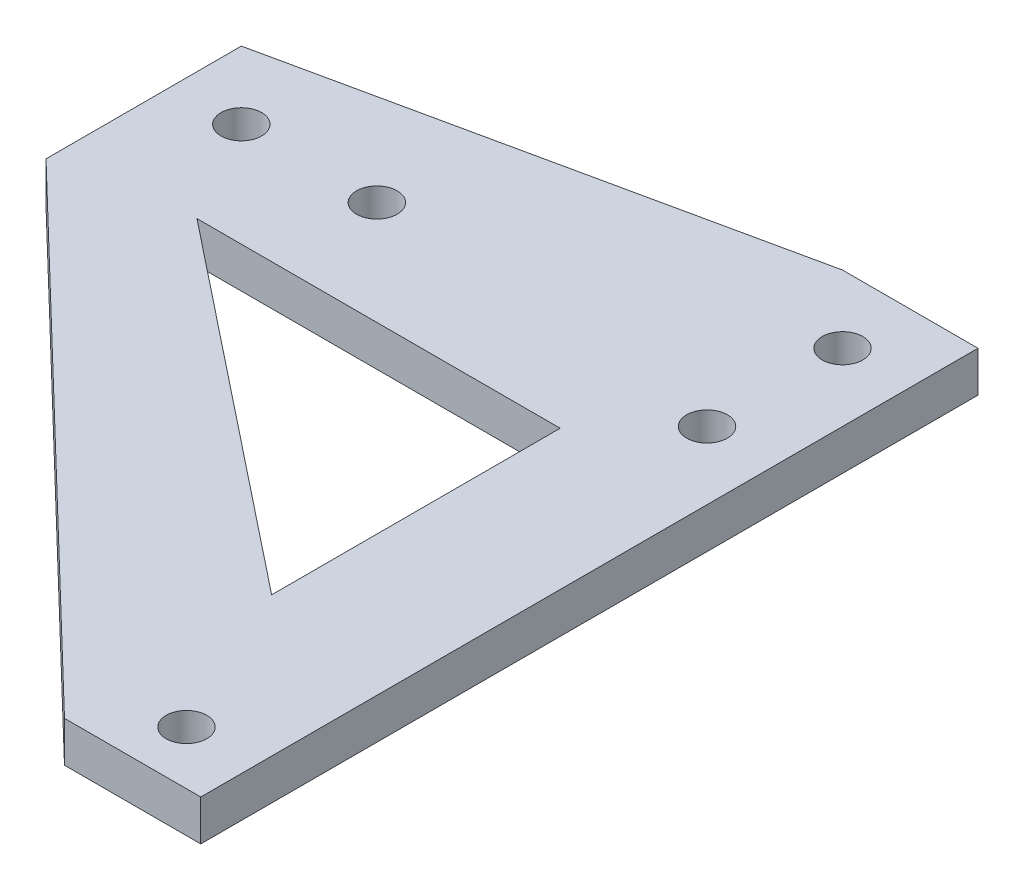
ISO-10303-21;
HEADER;
FILE_DESCRIPTION(('STEP AP214'),'2;1');
FILE_NAME('part.step','',(''),(''),'','','');
FILE_SCHEMA(('AUTOMOTIVE_DESIGN { 1 0 10303 214 1 1 1 1 }'));
ENDSEC;
DATA;
#1=APPLICATION_CONTEXT('core data for automotive mechanical design processes');
#2=APPLICATION_PROTOCOL_DEFINITION('international standard','automotive_design',2000,#1);
#3=PRODUCT_CONTEXT('',#1,'mechanical');
#4=PRODUCT('Part','Part','',(#3));
#5=PRODUCT_RELATED_PRODUCT_CATEGORY('part','',(#4));
#6=PRODUCT_DEFINITION_FORMATION('','',#4);
#7=PRODUCT_DEFINITION_CONTEXT('part definition',#1,'design');
#8=PRODUCT_DEFINITION('design','',#6,#7);
#9=PRODUCT_DEFINITION_SHAPE('','',#8);
#10=(LENGTH_UNIT() NAMED_UNIT(*) SI_UNIT(.MILLI.,.METRE.));
#11=(NAMED_UNIT(*) PLANE_ANGLE_UNIT() SI_UNIT($,.RADIAN.));
#12=(NAMED_UNIT(*) SI_UNIT($,.STERADIAN.) SOLID_ANGLE_UNIT());
#13=UNCERTAINTY_MEASURE_WITH_UNIT(LENGTH_MEASURE(1.E-05),#10,'distance_accuracy_value','');
#14=(GEOMETRIC_REPRESENTATION_CONTEXT(3) GLOBAL_UNCERTAINTY_ASSIGNED_CONTEXT((#13)) GLOBAL_UNIT_ASSIGNED_CONTEXT((#10,
#11,#12)) REPRESENTATION_CONTEXT('',''));
#15=CARTESIAN_POINT('',(0.,0.,0.));
#16=DIRECTION('',(0.,0.,1.));
#17=DIRECTION('',(1.,0.,0.));
#18=AXIS2_PLACEMENT_3D('',#15,#16,#17);
#19=CARTESIAN_POINT('',(0.,3.,-64.6));
#20=DIRECTION('',(0.,0.,1.));
#21=DIRECTION('',(1.,0.,0.));
#22=AXIS2_PLACEMENT_3D('',#19,#20,#21);
#23=PLANE('',#22);
#24=DIRECTION('',(-1.,0.,0.));
#25=VECTOR('',#24,1.);
#26=CARTESIAN_POINT('',(0.,0.,-64.6));
#27=LINE('',#26,#25);
#28=CARTESIAN_POINT('',(41.5,0.,-64.6));
#29=VERTEX_POINT('',#28);
#30=CARTESIAN_POINT('',(31.5,0.,-64.6));
#31=VERTEX_POINT('',#30);
#32=EDGE_CURVE('E198',#29,#31,#27,.T.);
#33=ORIENTED_EDGE('',*,*,#32,.T.);
#34=DIRECTION('',(0.,-1.,0.));
#35=VECTOR('',#34,1.);
#36=CARTESIAN_POINT('',(31.5,3.,-64.6));
#37=LINE('',#36,#35);
#38=CARTESIAN_POINT('',(31.5,3.,-64.6));
#39=VERTEX_POINT('',#38);
#40=EDGE_CURVE('E234',#39,#31,#37,.T.);
#41=ORIENTED_EDGE('',*,*,#40,.F.);
#42=DIRECTION('',(-1.,0.,0.));
#43=VECTOR('',#42,1.);
#44=CARTESIAN_POINT('',(0.,3.,-64.6));
#45=LINE('',#44,#43);
#46=CARTESIAN_POINT('',(41.5,3.,-64.6));
#47=VERTEX_POINT('',#46);
#48=EDGE_CURVE('E165',#47,#39,#45,.T.);
#49=ORIENTED_EDGE('',*,*,#48,.F.);
#50=DIRECTION('',(0.,-1.,0.));
#51=VECTOR('',#50,1.);
#52=CARTESIAN_POINT('',(41.5,3.,-64.6));
#53=LINE('',#52,#51);
#54=EDGE_CURVE('E197',#47,#29,#53,.T.);
#55=ORIENTED_EDGE('',*,*,#54,.T.);
#56=EDGE_LOOP('',(#33,#41,#49,#55));
#57=FACE_BOUND('',#56,.T.);
#58=ADVANCED_FACE('F45',(#57),#23,.F.);
#59=CARTESIAN_POINT('',(-11.9106417152535,3.,-55.2399520466015));
#60=DIRECTION('',(0.210772639150553,0.,0.97753511168935));
#61=DIRECTION('',(0.977535111689351,0.,-0.210772639150553));
#62=AXIS2_PLACEMENT_3D('',#59,#60,#61);
#63=PLANE('',#62);
#64=DIRECTION('',(-0.977535111689351,0.,0.210772639150553));
#65=VECTOR('',#64,1.);
#66=CARTESIAN_POINT('',(-11.9106417152535,0.,-55.2399520466015));
#67=LINE('',#66,#65);
#68=CARTESIAN_POINT('',(-5.,0.,-56.73));
#69=VERTEX_POINT('',#68);
#70=EDGE_CURVE('E202',#31,#69,#67,.T.);
#71=ORIENTED_EDGE('',*,*,#70,.T.);
#72=DIRECTION('',(0.,-1.,0.));
#73=VECTOR('',#72,1.);
#74=CARTESIAN_POINT('',(-5.,3.,-56.73));
#75=LINE('',#74,#73);
#76=CARTESIAN_POINT('',(-5.,3.,-56.73));
#77=VERTEX_POINT('',#76);
#78=EDGE_CURVE('E230',#77,#69,#75,.T.);
#79=ORIENTED_EDGE('',*,*,#78,.F.);
#80=DIRECTION('',(-0.977535111689351,0.,0.210772639150553));
#81=VECTOR('',#80,1.);
#82=CARTESIAN_POINT('',(-11.9106417152535,3.,-55.2399520466015));
#83=LINE('',#82,#81);
#84=EDGE_CURVE('E169',#39,#77,#83,.T.);
#85=ORIENTED_EDGE('',*,*,#84,.F.);
#86=ORIENTED_EDGE('',*,*,#40,.T.);
#87=EDGE_LOOP('',(#71,#79,#85,#86));
#88=FACE_BOUND('',#87,.T.);
#89=ADVANCED_FACE('F269',(#88),#63,.F.);
#90=CARTESIAN_POINT('',(-5.,3.,0.));
#91=DIRECTION('',(1.,0.,0.));
#92=DIRECTION('',(0.,0.,-1.));
#93=AXIS2_PLACEMENT_3D('',#90,#91,#92);
#94=PLANE('',#93);
#95=DIRECTION('',(0.,0.,1.));
#96=VECTOR('',#95,1.);
#97=CARTESIAN_POINT('',(-5.,0.,0.));
#98=LINE('',#97,#96);
#99=CARTESIAN_POINT('',(-5.,0.,-42.3127995725989));
#100=VERTEX_POINT('',#99);
#101=EDGE_CURVE('E205',#69,#100,#98,.T.);
#102=ORIENTED_EDGE('',*,*,#101,.T.);
#103=DIRECTION('',(0.,1.,0.));
#104=VECTOR('',#103,1.);
#105=CARTESIAN_POINT('',(-5.,-4.,-42.3127995725989));
#106=LINE('',#105,#104);
#107=CARTESIAN_POINT('',(-5.,3.,-42.3127995725989));
#108=VERTEX_POINT('',#107);
#109=EDGE_CURVE('E145',#100,#108,#106,.T.);
#110=ORIENTED_EDGE('',*,*,#109,.T.);
#111=DIRECTION('',(0.,0.,1.));
#112=VECTOR('',#111,1.);
#113=CARTESIAN_POINT('',(-5.,3.,0.));
#114=LINE('',#113,#112);
#115=EDGE_CURVE('E173',#77,#108,#114,.T.);
#116=ORIENTED_EDGE('',*,*,#115,.F.);
#117=ORIENTED_EDGE('',*,*,#78,.T.);
#118=EDGE_LOOP('',(#102,#110,#116,#117));
#119=FACE_BOUND('',#118,.T.);
#120=ADVANCED_FACE('F274',(#119),#94,.F.);
#121=CARTESIAN_POINT('',(36.5,3.,-49.6));
#122=DIRECTION('',(0.,-1.,0.));
#123=DIRECTION('',(0.,0.,-1.));
#124=AXIS2_PLACEMENT_3D('',#121,#122,#123);
#125=CYLINDRICAL_SURFACE('',#124,1.5);
#126=CARTESIAN_POINT('',(36.5,3.,-49.6));
#127=DIRECTION('',(0.,1.,0.));
#128=DIRECTION('',(0.,0.,1.));
#129=AXIS2_PLACEMENT_3D('',#126,#127,#128);
#130=CIRCLE('',#129,1.5);
#131=CARTESIAN_POINT('',(36.5,3.,-48.1));
#132=VERTEX_POINT('',#131);
#133=EDGE_CURVE('E189',#132,#132,#130,.T.);
#134=ORIENTED_EDGE('',*,*,#133,.T.);
#135=EDGE_LOOP('',(#134));
#136=FACE_BOUND('',#135,.T.);
#137=CARTESIAN_POINT('',(36.5,0.,-49.6));
#138=DIRECTION('',(0.,1.,0.));
#139=DIRECTION('',(0.,0.,1.));
#140=AXIS2_PLACEMENT_3D('',#137,#138,#139);
#141=CIRCLE('',#140,1.5);
#142=CARTESIAN_POINT('',(36.5,0.,-48.1));
#143=VERTEX_POINT('',#142);
#144=EDGE_CURVE('E221',#143,#143,#141,.T.);
#145=ORIENTED_EDGE('',*,*,#144,.F.);
#146=EDGE_LOOP('',(#145));
#147=FACE_BOUND('',#146,.T.);
#148=ADVANCED_FACE('F295',(#136,#147),#125,.F.);
#149=CARTESIAN_POINT('',(36.5,3.,-59.6));
#150=DIRECTION('',(0.,-1.,0.));
#151=DIRECTION('',(0.,0.,-1.));
#152=AXIS2_PLACEMENT_3D('',#149,#150,#151);
#153=CYLINDRICAL_SURFACE('',#152,1.5);
#154=CARTESIAN_POINT('',(36.5,3.,-59.6));
#155=DIRECTION('',(0.,1.,0.));
#156=DIRECTION('',(0.,0.,1.));
#157=AXIS2_PLACEMENT_3D('',#154,#155,#156);
#158=CIRCLE('',#157,1.5);
#159=CARTESIAN_POINT('',(36.5,3.,-58.1));
#160=VERTEX_POINT('',#159);
#161=EDGE_CURVE('E185',#160,#160,#158,.T.);
#162=ORIENTED_EDGE('',*,*,#161,.T.);
#163=EDGE_LOOP('',(#162));
#164=FACE_BOUND('',#163,.T.);
#165=CARTESIAN_POINT('',(36.5,0.,-59.6));
#166=DIRECTION('',(0.,1.,0.));
#167=DIRECTION('',(0.,0.,1.));
#168=AXIS2_PLACEMENT_3D('',#165,#166,#167);
#169=CIRCLE('',#168,1.5);
#170=CARTESIAN_POINT('',(36.5,0.,-58.1));
#171=VERTEX_POINT('',#170);
#172=EDGE_CURVE('E217',#171,#171,#169,.T.);
#173=ORIENTED_EDGE('',*,*,#172,.F.);
#174=EDGE_LOOP('',(#173));
#175=FACE_BOUND('',#174,.T.);
#176=ADVANCED_FACE('F300',(#164,#175),#153,.F.);
#177=CARTESIAN_POINT('',(36.5,3.,-11.18));
#178=DIRECTION('',(0.,-1.,0.));
#179=DIRECTION('',(0.,0.,-1.));
#180=AXIS2_PLACEMENT_3D('',#177,#178,#179);
#181=CYLINDRICAL_SURFACE('',#180,1.5);
#182=CARTESIAN_POINT('',(36.5,3.,-11.18));
#183=DIRECTION('',(0.,1.,0.));
#184=DIRECTION('',(0.,0.,1.));
#185=AXIS2_PLACEMENT_3D('',#182,#183,#184);
#186=CIRCLE('',#185,1.5);
#187=CARTESIAN_POINT('',(36.5,3.,-9.67999999999999));
#188=VERTEX_POINT('',#187);
#189=EDGE_CURVE('E181',#188,#188,#186,.T.);
#190=ORIENTED_EDGE('',*,*,#189,.T.);
#191=EDGE_LOOP('',(#190));
#192=FACE_BOUND('',#191,.T.);
#193=CARTESIAN_POINT('',(36.5,0.,-11.18));
#194=DIRECTION('',(0.,1.,0.));
#195=DIRECTION('',(0.,0.,1.));
#196=AXIS2_PLACEMENT_3D('',#193,#194,#195);
#197=CIRCLE('',#196,1.5);
#198=CARTESIAN_POINT('',(36.5,0.,-9.67999999999999));
#199=VERTEX_POINT('',#198);
#200=EDGE_CURVE('E213',#199,#199,#197,.T.);
#201=ORIENTED_EDGE('',*,*,#200,.F.);
#202=EDGE_LOOP('',(#201));
#203=FACE_BOUND('',#202,.T.);
#204=ADVANCED_FACE('F307',(#192,#203),#181,.F.);
#205=CARTESIAN_POINT('',(41.5,3.,0.));
#206=DIRECTION('',(1.,0.,0.));
#207=DIRECTION('',(0.,0.,-1.));
#208=AXIS2_PLACEMENT_3D('',#205,#206,#207);
#209=PLANE('',#208);
#210=DIRECTION('',(0.,1.,0.));
#211=VECTOR('',#210,1.);
#212=CARTESIAN_POINT('',(41.5,-4.,-7.23402453897604));
#213=LINE('',#212,#211);
#214=CARTESIAN_POINT('',(41.5,0.,-7.23402453897604));
#215=VERTEX_POINT('',#214);
#216=CARTESIAN_POINT('',(41.5,3.,-7.23402453897604));
#217=VERTEX_POINT('',#216);
#218=EDGE_CURVE('E157',#215,#217,#213,.T.);
#219=ORIENTED_EDGE('',*,*,#218,.F.);
#220=DIRECTION('',(0.,0.,1.));
#221=VECTOR('',#220,1.);
#222=CARTESIAN_POINT('',(41.5,0.,0.));
#223=LINE('',#222,#221);
#224=EDGE_CURVE('E209',#29,#215,#223,.T.);
#225=ORIENTED_EDGE('',*,*,#224,.F.);
#226=ORIENTED_EDGE('',*,*,#54,.F.);
#227=DIRECTION('',(0.,0.,1.));
#228=VECTOR('',#227,1.);
#229=CARTESIAN_POINT('',(41.5,3.,0.));
#230=LINE('',#229,#228);
#231=EDGE_CURVE('E177',#47,#217,#230,.T.);
#232=ORIENTED_EDGE('',*,*,#231,.T.);
#233=EDGE_LOOP('',(#219,#225,#226,#232));
#234=FACE_BOUND('',#233,.T.);
#235=ADVANCED_FACE('F285',(#234),#209,.T.);
#236=CARTESIAN_POINT('',(0.,3.,-51.73));
#237=DIRECTION('',(0.,-1.,0.));
#238=DIRECTION('',(0.,0.,-1.));
#239=AXIS2_PLACEMENT_3D('',#236,#237,#238);
#240=CYLINDRICAL_SURFACE('',#239,1.5);
#241=CARTESIAN_POINT('',(0.,3.,-51.73));
#242=DIRECTION('',(0.,1.,0.));
#243=DIRECTION('',(0.,0.,1.));
#244=AXIS2_PLACEMENT_3D('',#241,#242,#243);
#245=CIRCLE('',#244,1.5);
#246=CARTESIAN_POINT('',(0.,3.,-50.23));
#247=VERTEX_POINT('',#246);
#248=EDGE_CURVE('E193',#247,#247,#245,.T.);
#249=ORIENTED_EDGE('',*,*,#248,.T.);
#250=EDGE_LOOP('',(#249));
#251=FACE_BOUND('',#250,.T.);
#252=CARTESIAN_POINT('',(0.,0.,-51.73));
#253=DIRECTION('',(0.,1.,0.));
#254=DIRECTION('',(0.,0.,1.));
#255=AXIS2_PLACEMENT_3D('',#252,#253,#254);
#256=CIRCLE('',#255,1.5);
#257=CARTESIAN_POINT('',(0.,0.,-50.23));
#258=VERTEX_POINT('',#257);
#259=EDGE_CURVE('E170',#258,#258,#256,.T.);
#260=ORIENTED_EDGE('',*,*,#259,.F.);
#261=EDGE_LOOP('',(#260));
#262=FACE_BOUND('',#261,.T.);
#263=ADVANCED_FACE('F306',(#251,#262),#240,.F.);
#264=CARTESIAN_POINT('',(0.,3.,0.));
#265=DIRECTION('',(0.,1.,0.));
#266=DIRECTION('',(0.,0.,1.));
#267=AXIS2_PLACEMENT_3D('',#264,#265,#266);
#268=PLANE('',#267);
#269=DIRECTION('',(0.783006018890345,0.,0.622014127155882));
#270=VECTOR('',#269,1.);
#271=CARTESIAN_POINT('',(4.38834668059727,3.,-44.066382221439));
#272=LINE('',#271,#270);
#273=CARTESIAN_POINT('',(4.38834668059727,3.,-44.066382221439));
#274=VERTEX_POINT('',#273);
#275=CARTESIAN_POINT('',(31.1931100271531,3.,-22.7728786283806));
#276=VERTEX_POINT('',#275);
#277=EDGE_CURVE('E60',#274,#276,#272,.T.);
#278=ORIENTED_EDGE('',*,*,#277,.F.);
#279=DIRECTION('',(-1.,0.,0.));
#280=VECTOR('',#279,1.);
#281=CARTESIAN_POINT('',(31.1931100271531,3.,-44.066382221439));
#282=LINE('',#281,#280);
#283=CARTESIAN_POINT('',(31.1931100271531,3.,-44.066382221439));
#284=VERTEX_POINT('',#283);
#285=EDGE_CURVE('E119',#284,#274,#282,.T.);
#286=ORIENTED_EDGE('',*,*,#285,.F.);
#287=DIRECTION('',(0.,0.,-1.));
#288=VECTOR('',#287,1.);
#289=CARTESIAN_POINT('',(31.1931100271531,3.,-22.7728786283806));
#290=LINE('',#289,#288);
#291=EDGE_CURVE('E127',#276,#284,#290,.T.);
#292=ORIENTED_EDGE('',*,*,#291,.F.);
#293=EDGE_LOOP('',(#278,#286,#292));
#294=FACE_BOUND('',#293,.T.);
#295=DIRECTION('',(-0.720469182110105,0.,-0.693486955630455));
#296=VECTOR('',#295,1.);
#297=CARTESIAN_POINT('',(31.4436218341303,3.,-7.23402453897604));
#298=LINE('',#297,#296);
#299=CARTESIAN_POINT('',(31.4436218341303,3.,-7.23402453897604));
#300=VERTEX_POINT('',#299);
#301=EDGE_CURVE('E141',#300,#108,#298,.T.);
#302=ORIENTED_EDGE('',*,*,#301,.F.);
#303=DIRECTION('',(-1.,0.,0.));
#304=VECTOR('',#303,1.);
#305=CARTESIAN_POINT('',(-5.,3.,-7.23402453897604));
#306=LINE('',#305,#304);
#307=EDGE_CURVE('E153',#217,#300,#306,.T.);
#308=ORIENTED_EDGE('',*,*,#307,.F.);
#309=ORIENTED_EDGE('',*,*,#231,.F.);
#310=ORIENTED_EDGE('',*,*,#48,.T.);
#311=ORIENTED_EDGE('',*,*,#84,.T.);
#312=ORIENTED_EDGE('',*,*,#115,.T.);
#313=EDGE_LOOP('',(#302,#308,#309,#310,#311,#312));
#314=FACE_BOUND('',#313,.T.);
#315=CARTESIAN_POINT('',(10.,3.,-51.73));
#316=DIRECTION('',(0.,1.,0.));
#317=DIRECTION('',(0.,0.,1.));
#318=AXIS2_PLACEMENT_3D('',#315,#316,#317);
#319=CIRCLE('',#318,1.5);
#320=CARTESIAN_POINT('',(10.,3.,-50.23));
#321=VERTEX_POINT('',#320);
#322=EDGE_CURVE('E160',#321,#321,#319,.T.);
#323=ORIENTED_EDGE('',*,*,#322,.F.);
#324=EDGE_LOOP('',(#323));
#325=FACE_BOUND('',#324,.T.);
#326=ORIENTED_EDGE('',*,*,#189,.F.);
#327=EDGE_LOOP('',(#326));
#328=FACE_BOUND('',#327,.T.);
#329=ORIENTED_EDGE('',*,*,#161,.F.);
#330=EDGE_LOOP('',(#329));
#331=FACE_BOUND('',#330,.T.);
#332=ORIENTED_EDGE('',*,*,#133,.F.);
#333=EDGE_LOOP('',(#332));
#334=FACE_BOUND('',#333,.T.);
#335=ORIENTED_EDGE('',*,*,#248,.F.);
#336=EDGE_LOOP('',(#335));
#337=FACE_BOUND('',#336,.T.);
#338=ADVANCED_FACE('F132',(#294,#314,#325,#328,#331,#334,#337),#268,.T.);
#339=CARTESIAN_POINT('',(0.,0.,0.));
#340=DIRECTION('',(0.,1.,0.));
#341=DIRECTION('',(0.,0.,1.));
#342=AXIS2_PLACEMENT_3D('',#339,#340,#341);
#343=PLANE('',#342);
#344=DIRECTION('',(-1.,0.,0.));
#345=VECTOR('',#344,1.);
#346=CARTESIAN_POINT('',(0.,0.,-44.066382221439));
#347=LINE('',#346,#345);
#348=CARTESIAN_POINT('',(31.1931100271531,0.,-44.066382221439));
#349=VERTEX_POINT('',#348);
#350=CARTESIAN_POINT('',(4.38834668059727,0.,-44.066382221439));
#351=VERTEX_POINT('',#350);
#352=EDGE_CURVE('E53',#349,#351,#347,.T.);
#353=ORIENTED_EDGE('',*,*,#352,.T.);
#354=DIRECTION('',(0.783006018890345,0.,0.622014127155882));
#355=VECTOR('',#354,1.);
#356=CARTESIAN_POINT('',(23.1599845277553,0.,-29.1543334643508));
#357=LINE('',#356,#355);
#358=CARTESIAN_POINT('',(31.1931100271531,0.,-22.7728786283806));
#359=VERTEX_POINT('',#358);
#360=EDGE_CURVE('E11',#351,#359,#357,.T.);
#361=ORIENTED_EDGE('',*,*,#360,.T.);
#362=DIRECTION('',(0.,0.,-1.));
#363=VECTOR('',#362,1.);
#364=CARTESIAN_POINT('',(31.1931100271531,0.,0.));
#365=LINE('',#364,#363);
#366=EDGE_CURVE('E249',#359,#349,#365,.T.);
#367=ORIENTED_EDGE('',*,*,#366,.T.);
#368=EDGE_LOOP('',(#353,#361,#367));
#369=FACE_BOUND('',#368,.T.);
#370=CARTESIAN_POINT('',(10.,0.,-51.73));
#371=DIRECTION('',(0.,1.,0.));
#372=DIRECTION('',(0.,0.,1.));
#373=AXIS2_PLACEMENT_3D('',#370,#371,#372);
#374=CIRCLE('',#373,1.5);
#375=CARTESIAN_POINT('',(10.,0.,-50.23));
#376=VERTEX_POINT('',#375);
#377=EDGE_CURVE('E164',#376,#376,#374,.T.);
#378=ORIENTED_EDGE('',*,*,#377,.T.);
#379=EDGE_LOOP('',(#378));
#380=FACE_BOUND('',#379,.T.);
#381=DIRECTION('',(-1.,0.,0.));
#382=VECTOR('',#381,1.);
#383=CARTESIAN_POINT('',(0.,0.,-7.23402453897604));
#384=LINE('',#383,#382);
#385=CARTESIAN_POINT('',(31.4436218341303,0.,-7.23402453897604));
#386=VERTEX_POINT('',#385);
#387=EDGE_CURVE('E238',#215,#386,#384,.T.);
#388=ORIENTED_EDGE('',*,*,#387,.T.);
#389=DIRECTION('',(-0.720469182110105,0.,-0.693486955630455));
#390=VECTOR('',#389,1.);
#391=CARTESIAN_POINT('',(18.7363762813039,0.,-19.4653721825613));
#392=LINE('',#391,#390);
#393=EDGE_CURVE('E149',#386,#100,#392,.T.);
#394=ORIENTED_EDGE('',*,*,#393,.T.);
#395=ORIENTED_EDGE('',*,*,#101,.F.);
#396=ORIENTED_EDGE('',*,*,#70,.F.);
#397=ORIENTED_EDGE('',*,*,#32,.F.);
#398=ORIENTED_EDGE('',*,*,#224,.T.);
#399=EDGE_LOOP('',(#388,#394,#395,#396,#397,#398));
#400=FACE_BOUND('',#399,.T.);
#401=ORIENTED_EDGE('',*,*,#200,.T.);
#402=EDGE_LOOP('',(#401));
#403=FACE_BOUND('',#402,.T.);
#404=ORIENTED_EDGE('',*,*,#172,.T.);
#405=EDGE_LOOP('',(#404));
#406=FACE_BOUND('',#405,.T.);
#407=ORIENTED_EDGE('',*,*,#144,.T.);
#408=EDGE_LOOP('',(#407));
#409=FACE_BOUND('',#408,.T.);
#410=ORIENTED_EDGE('',*,*,#259,.T.);
#411=EDGE_LOOP('',(#410));
#412=FACE_BOUND('',#411,.T.);
#413=ADVANCED_FACE('F253',(#369,#380,#400,#403,#406,#409,#412),#343,.F.);
#414=CARTESIAN_POINT('',(10.,-4.,-51.73));
#415=DIRECTION('',(0.,1.,0.));
#416=DIRECTION('',(0.,0.,1.));
#417=AXIS2_PLACEMENT_3D('',#414,#415,#416);
#418=CYLINDRICAL_SURFACE('',#417,1.5);
#419=ORIENTED_EDGE('',*,*,#322,.T.);
#420=EDGE_LOOP('',(#419));
#421=FACE_BOUND('',#420,.T.);
#422=ORIENTED_EDGE('',*,*,#377,.F.);
#423=EDGE_LOOP('',(#422));
#424=FACE_BOUND('',#423,.T.);
#425=ADVANCED_FACE('F319',(#421,#424),#418,.F.);
#426=CARTESIAN_POINT('',(-5.,-4.,-7.23402453897604));
#427=DIRECTION('',(0.,0.,-1.));
#428=DIRECTION('',(-1.,0.,0.));
#429=AXIS2_PLACEMENT_3D('',#426,#427,#428);
#430=PLANE('',#429);
#431=ORIENTED_EDGE('',*,*,#307,.T.);
#432=DIRECTION('',(0.,-1.,0.));
#433=VECTOR('',#432,1.);
#434=CARTESIAN_POINT('',(31.4436218341303,-4.,-7.23402453897604));
#435=LINE('',#434,#433);
#436=EDGE_CURVE('E245',#300,#386,#435,.T.);
#437=ORIENTED_EDGE('',*,*,#436,.T.);
#438=ORIENTED_EDGE('',*,*,#387,.F.);
#439=ORIENTED_EDGE('',*,*,#218,.T.);
#440=EDGE_LOOP('',(#431,#437,#438,#439));
#441=FACE_BOUND('',#440,.T.);
#442=ADVANCED_FACE('F264',(#441),#430,.F.);
#443=CARTESIAN_POINT('',(31.4436218341303,-4.,-7.23402453897604));
#444=DIRECTION('',(0.693486955630455,0.,-0.720469182110105));
#445=DIRECTION('',(-0.720469182110105,0.,-0.693486955630455));
#446=AXIS2_PLACEMENT_3D('',#443,#444,#445);
#447=PLANE('',#446);
#448=ORIENTED_EDGE('',*,*,#436,.F.);
#449=ORIENTED_EDGE('',*,*,#301,.T.);
#450=ORIENTED_EDGE('',*,*,#109,.F.);
#451=ORIENTED_EDGE('',*,*,#393,.F.);
#452=EDGE_LOOP('',(#448,#449,#450,#451));
#453=FACE_BOUND('',#452,.T.);
#454=ADVANCED_FACE('F257',(#453),#447,.F.);
#455=CARTESIAN_POINT('',(4.38834668059727,-4.,-44.066382221439));
#456=DIRECTION('',(-0.622014127155882,0.,0.783006018890345));
#457=DIRECTION('',(0.783006018890345,0.,0.622014127155882));
#458=AXIS2_PLACEMENT_3D('',#455,#456,#457);
#459=PLANE('',#458);
#460=DIRECTION('',(0.,1.,0.));
#461=VECTOR('',#460,1.);
#462=CARTESIAN_POINT('',(4.38834668059727,-4.,-44.066382221439));
#463=LINE('',#462,#461);
#464=EDGE_CURVE('E123',#351,#274,#463,.T.);
#465=ORIENTED_EDGE('',*,*,#464,.T.);
#466=ORIENTED_EDGE('',*,*,#277,.T.);
#467=DIRECTION('',(0.,1.,0.));
#468=VECTOR('',#467,1.);
#469=CARTESIAN_POINT('',(31.1931100271531,-4.,-22.7728786283806));
#470=LINE('',#469,#468);
#471=EDGE_CURVE('E124',#359,#276,#470,.T.);
#472=ORIENTED_EDGE('',*,*,#471,.F.);
#473=ORIENTED_EDGE('',*,*,#360,.F.);
#474=EDGE_LOOP('',(#465,#466,#472,#473));
#475=FACE_BOUND('',#474,.T.);
#476=ADVANCED_FACE('F255',(#475),#459,.F.);
#477=CARTESIAN_POINT('',(31.1931100271531,-4.,-44.066382221439));
#478=DIRECTION('',(0.,0.,-1.));
#479=DIRECTION('',(-1.,0.,0.));
#480=AXIS2_PLACEMENT_3D('',#477,#478,#479);
#481=PLANE('',#480);
#482=DIRECTION('',(0.,1.,0.));
#483=VECTOR('',#482,1.);
#484=CARTESIAN_POINT('',(31.1931100271531,-4.,-44.066382221439));
#485=LINE('',#484,#483);
#486=EDGE_CURVE('E68',#349,#284,#485,.T.);
#487=ORIENTED_EDGE('',*,*,#486,.T.);
#488=ORIENTED_EDGE('',*,*,#285,.T.);
#489=ORIENTED_EDGE('',*,*,#464,.F.);
#490=ORIENTED_EDGE('',*,*,#352,.F.);
#491=EDGE_LOOP('',(#487,#488,#489,#490));
#492=FACE_BOUND('',#491,.T.);
#493=ADVANCED_FACE('F116',(#492),#481,.F.);
#494=CARTESIAN_POINT('',(31.1931100271531,-4.,-22.7728786283806));
#495=DIRECTION('',(1.,0.,0.));
#496=DIRECTION('',(0.,0.,-1.));
#497=AXIS2_PLACEMENT_3D('',#494,#495,#496);
#498=PLANE('',#497);
#499=ORIENTED_EDGE('',*,*,#471,.T.);
#500=ORIENTED_EDGE('',*,*,#291,.T.);
#501=ORIENTED_EDGE('',*,*,#486,.F.);
#502=ORIENTED_EDGE('',*,*,#366,.F.);
#503=EDGE_LOOP('',(#499,#500,#501,#502));
#504=FACE_BOUND('',#503,.T.);
#505=ADVANCED_FACE('F128',(#504),#498,.F.);
#506=CLOSED_SHELL('',(#58,#89,#120,#148,#176,#204,#235,#263,#338,#413,#425,#442,#454,#476,#493,#505));
#507=MANIFOLD_SOLID_BREP('B2',#506);
#508=ADVANCED_BREP_SHAPE_REPRESENTATION('',(#18,#507),#14);
#509=SHAPE_DEFINITION_REPRESENTATION(#9,#508);
ENDSEC;
END-ISO-10303-21;
